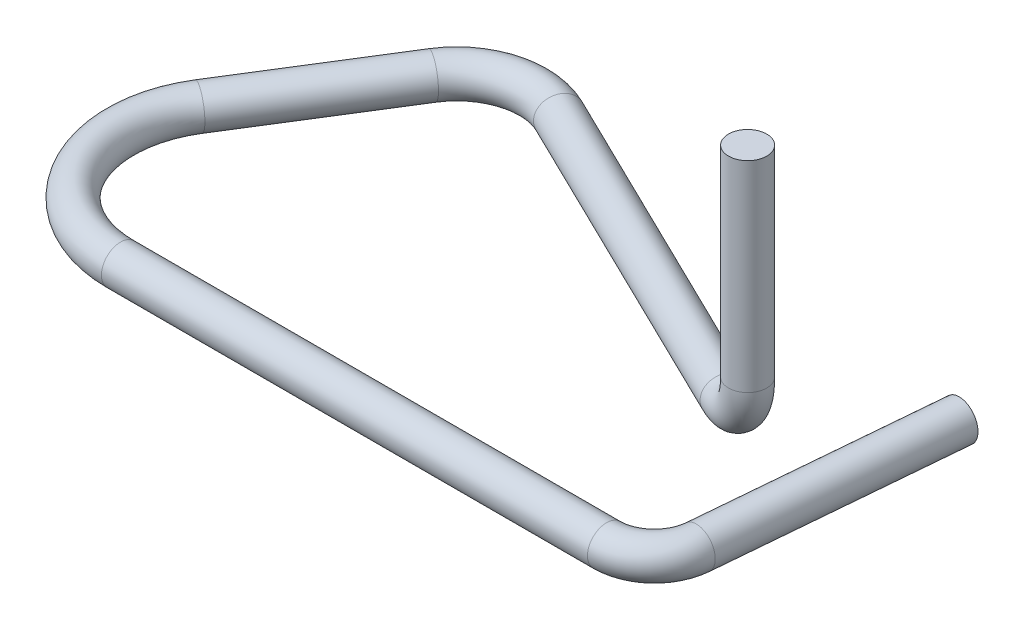
ISO-10303-21;
HEADER;
FILE_DESCRIPTION(('STEP AP214'),'2;1');
FILE_NAME('part.step','',(''),(''),'','','');
FILE_SCHEMA(('AUTOMOTIVE_DESIGN { 1 0 10303 214 1 1 1 1 }'));
ENDSEC;
DATA;
#1=APPLICATION_CONTEXT('core data for automotive mechanical design processes');
#2=APPLICATION_PROTOCOL_DEFINITION('international standard','automotive_design',2000,#1);
#3=PRODUCT_CONTEXT('',#1,'mechanical');
#4=PRODUCT('Part','Part','',(#3));
#5=PRODUCT_RELATED_PRODUCT_CATEGORY('part','',(#4));
#6=PRODUCT_DEFINITION_FORMATION('','',#4);
#7=PRODUCT_DEFINITION_CONTEXT('part definition',#1,'design');
#8=PRODUCT_DEFINITION('design','',#6,#7);
#9=PRODUCT_DEFINITION_SHAPE('','',#8);
#10=(LENGTH_UNIT() NAMED_UNIT(*) SI_UNIT(.MILLI.,.METRE.));
#11=(NAMED_UNIT(*) PLANE_ANGLE_UNIT() SI_UNIT($,.RADIAN.));
#12=(NAMED_UNIT(*) SI_UNIT($,.STERADIAN.) SOLID_ANGLE_UNIT());
#13=UNCERTAINTY_MEASURE_WITH_UNIT(LENGTH_MEASURE(1.E-05),#10,'distance_accuracy_value','');
#14=(GEOMETRIC_REPRESENTATION_CONTEXT(3) GLOBAL_UNCERTAINTY_ASSIGNED_CONTEXT((#13)) GLOBAL_UNIT_ASSIGNED_CONTEXT((#10,
#11,#12)) REPRESENTATION_CONTEXT('',''));
#15=CARTESIAN_POINT('',(0.,0.,0.));
#16=DIRECTION('',(0.,0.,1.));
#17=DIRECTION('',(1.,0.,0.));
#18=AXIS2_PLACEMENT_3D('',#15,#16,#17);
#19=CARTESIAN_POINT('',(17.7285697237176,0.,-1.66731220671047));
#20=DIRECTION('',(0.0871557427476609,0.,-0.996194698091745));
#21=DIRECTION('',(-0.996194698091745,0.,-0.0871557427476609));
#22=AXIS2_PLACEMENT_3D('',#19,#20,#21);
#23=CYLINDRICAL_SURFACE('',#22,0.508000000000002);
#24=CARTESIAN_POINT('',(17.7285697237176,0.,-1.66731220671047));
#25=DIRECTION('',(-0.0871557427476629,0.,0.996194698091745));
#26=DIRECTION('',(-0.895373863599654,-0.438371146789083,-0.078335062682381));
#27=AXIS2_PLACEMENT_3D('',#24,#25,#26);
#28=CIRCLE('',#27,0.508000000000002);
#29=CARTESIAN_POINT('',(18.2346366303482,0.,-1.62303708939466));
#30=VERTEX_POINT('',#29);
#31=EDGE_CURVE('E44',#30,#30,#28,.T.);
#32=ORIENTED_EDGE('',*,*,#31,.F.);
#33=EDGE_LOOP('',(#32));
#34=FACE_BOUND('',#33,.T.);
#35=CARTESIAN_POINT('',(18.2899330933694,0.,-8.08372488268419));
#36=DIRECTION('',(-0.0871557427476629,0.,0.996194698091745));
#37=DIRECTION('',(-0.895373863599654,-0.438371146789083,-0.078335062682381));
#38=AXIS2_PLACEMENT_3D('',#35,#36,#37);
#39=CIRCLE('',#38,0.508000000000002);
#40=CARTESIAN_POINT('',(17.8350831706608,-0.222692542568855,-8.12351909452684));
#41=VERTEX_POINT('',#40);
#42=EDGE_CURVE('E10',#41,#41,#39,.T.);
#43=ORIENTED_EDGE('',*,*,#42,.T.);
#44=EDGE_LOOP('',(#43));
#45=FACE_BOUND('',#44,.T.);
#46=ADVANCED_FACE('F37',(#34,#45),#23,.T.);
#47=CARTESIAN_POINT('',(16.4634024571411,0.,-1.778));
#48=DIRECTION('',(0.,1.,0.));
#49=DIRECTION('',(0.,0.,1.));
#50=AXIS2_PLACEMENT_3D('',#47,#48,#49);
#51=TOROIDAL_SURFACE('',#50,1.27,0.508000000000002);
#52=CARTESIAN_POINT('',(16.4634024571411,0.,-0.508000000000002));
#53=DIRECTION('',(-1.,0.,0.));
#54=DIRECTION('',(0.,-0.438371146789083,-0.898794046299165));
#55=AXIS2_PLACEMENT_3D('',#52,#53,#54);
#56=CIRCLE('',#55,0.508000000000002);
#57=CARTESIAN_POINT('',(16.4634024571411,0.,0.));
#58=VERTEX_POINT('',#57);
#59=EDGE_CURVE('E49',#58,#58,#56,.T.);
#60=CARTESIAN_POINT('',(16.4634024571411,0.,-1.778));
#61=DIRECTION('',(0.,1.,0.));
#62=DIRECTION('',(0.,0.,1.));
#63=AXIS2_PLACEMENT_3D('',#60,#61,#62);
#64=CIRCLE('',#63,1.778);
#65=EDGE_CURVE('',#58,#30,#64,.T.);
#66=ORIENTED_EDGE('',*,*,#59,.F.);
#67=ORIENTED_EDGE('',*,*,#31,.T.);
#68=ORIENTED_EDGE('',*,*,#65,.T.);
#69=ORIENTED_EDGE('',*,*,#65,.F.);
#70=EDGE_LOOP('',(#66,#68,#67,#69));
#71=FACE_BOUND('',#70,.T.);
#72=ADVANCED_FACE('F121',(#71),#51,.T.);
#73=CARTESIAN_POINT('',(3.556,0.,-0.508));
#74=DIRECTION('',(1.,0.,0.));
#75=DIRECTION('',(0.,0.,-1.));
#76=AXIS2_PLACEMENT_3D('',#73,#74,#75);
#77=CYLINDRICAL_SURFACE('',#76,0.508000000000002);
#78=CARTESIAN_POINT('',(3.556,0.,-0.508));
#79=DIRECTION('',(-1.,0.,0.));
#80=DIRECTION('',(0.,-0.438371146789083,-0.898794046299165));
#81=AXIS2_PLACEMENT_3D('',#78,#79,#80);
#82=CIRCLE('',#81,0.508000000000002);
#83=CARTESIAN_POINT('',(3.556,0.,0.));
#84=VERTEX_POINT('',#83);
#85=EDGE_CURVE('E54',#84,#84,#82,.T.);
#86=ORIENTED_EDGE('',*,*,#85,.F.);
#87=EDGE_LOOP('',(#86));
#88=FACE_BOUND('',#87,.T.);
#89=ORIENTED_EDGE('',*,*,#59,.T.);
#90=EDGE_LOOP('',(#89));
#91=FACE_BOUND('',#90,.T.);
#92=ADVANCED_FACE('F115',(#88,#91),#77,.T.);
#93=CARTESIAN_POINT('',(3.556,0.,-3.556));
#94=DIRECTION('',(0.,1.,0.));
#95=DIRECTION('',(0.,0.,1.));
#96=AXIS2_PLACEMENT_3D('',#93,#94,#95);
#97=TOROIDAL_SURFACE('',#96,3.048,0.508000000000002);
#98=CARTESIAN_POINT('',(0.971149402915214,0.,-5.17119391738281));
#99=DIRECTION('',(0.529919264233207,0.,-0.848048096156425));
#100=DIRECTION('',(0.762220579800736,-0.438371146789083,0.476288279712041));
#101=AXIS2_PLACEMENT_3D('',#98,#99,#100);
#102=CIRCLE('',#101,0.508000000000002);
#103=CARTESIAN_POINT('',(0.540340970067749,0.,-5.44039290361328));
#104=VERTEX_POINT('',#103);
#105=EDGE_CURVE('E60',#104,#104,#102,.T.);
#106=CARTESIAN_POINT('',(3.556,0.,-3.556));
#107=DIRECTION('',(0.,1.,0.));
#108=DIRECTION('',(0.,0.,1.));
#109=AXIS2_PLACEMENT_3D('',#106,#107,#108);
#110=CIRCLE('',#109,3.556);
#111=EDGE_CURVE('',#104,#84,#110,.T.);
#112=ORIENTED_EDGE('',*,*,#105,.F.);
#113=ORIENTED_EDGE('',*,*,#85,.T.);
#114=ORIENTED_EDGE('',*,*,#111,.T.);
#115=ORIENTED_EDGE('',*,*,#111,.F.);
#116=EDGE_LOOP('',(#112,#114,#113,#115));
#117=FACE_BOUND('',#116,.T.);
#118=ADVANCED_FACE('F109',(#117),#97,.T.);
#119=CARTESIAN_POINT('',(3.35676626861014,0.,-8.98897896061708));
#120=DIRECTION('',(-0.529919264233206,0.,0.848048096156425));
#121=DIRECTION('',(0.848048096156426,0.,0.529919264233206));
#122=AXIS2_PLACEMENT_3D('',#119,#120,#121);
#123=CYLINDRICAL_SURFACE('',#122,0.508000000000002);
#124=CARTESIAN_POINT('',(3.35676626861014,0.,-8.98897896061708));
#125=DIRECTION('',(0.529919264233207,0.,-0.848048096156425));
#126=DIRECTION('',(0.762220579800736,-0.438371146789083,0.476288279712041));
#127=AXIS2_PLACEMENT_3D('',#124,#125,#126);
#128=CIRCLE('',#127,0.508000000000002);
#129=CARTESIAN_POINT('',(2.92595783576267,0.,-9.25817794684755));
#130=VERTEX_POINT('',#129);
#131=EDGE_CURVE('E64',#130,#130,#128,.T.);
#132=ORIENTED_EDGE('',*,*,#131,.F.);
#133=EDGE_LOOP('',(#132));
#134=FACE_BOUND('',#133,.T.);
#135=ORIENTED_EDGE('',*,*,#105,.T.);
#136=EDGE_LOOP('',(#135));
#137=FACE_BOUND('',#136,.T.);
#138=ADVANCED_FACE('F103',(#134,#137),#123,.T.);
#139=CARTESIAN_POINT('',(5.08,0.,-7.91218301569521));
#140=DIRECTION('',(0.,1.,0.));
#141=DIRECTION('',(0.,0.,1.));
#142=AXIS2_PLACEMENT_3D('',#139,#140,#141);
#143=TOROIDAL_SURFACE('',#142,2.032,0.508000000000002);
#144=CARTESIAN_POINT('',(5.97077017027541,0.,-9.73853251777512));
#145=DIRECTION('',(0.898794046299165,0.,0.438371146789083));
#146=DIRECTION('',(-0.394005376803365,-0.438371146789083,0.807830737662825));
#147=AXIS2_PLACEMENT_3D('',#144,#145,#146);
#148=CIRCLE('',#147,0.508000000000002);
#149=CARTESIAN_POINT('',(6.19346271284427,0.,-10.1951198932951));
#150=VERTEX_POINT('',#149);
#151=EDGE_CURVE('E68',#150,#150,#148,.T.);
#152=CARTESIAN_POINT('',(5.08,0.,-7.91218301569521));
#153=DIRECTION('',(0.,1.,0.));
#154=DIRECTION('',(0.,0.,1.));
#155=AXIS2_PLACEMENT_3D('',#152,#153,#154);
#156=CIRCLE('',#155,2.54);
#157=EDGE_CURVE('',#150,#130,#156,.T.);
#158=ORIENTED_EDGE('',*,*,#151,.F.);
#159=ORIENTED_EDGE('',*,*,#131,.T.);
#160=ORIENTED_EDGE('',*,*,#157,.T.);
#161=ORIENTED_EDGE('',*,*,#157,.F.);
#162=EDGE_LOOP('',(#158,#160,#159,#161));
#163=FACE_BOUND('',#162,.T.);
#164=ADVANCED_FACE('F97',(#163),#143,.T.);
#165=CARTESIAN_POINT('',(14.6065315612001,0.,-5.52659026034225));
#166=DIRECTION('',(-0.898794046299164,0.,-0.438371146789083));
#167=DIRECTION('',(-0.438371146789083,0.,0.898794046299164));
#168=AXIS2_PLACEMENT_3D('',#165,#166,#167);
#169=CYLINDRICAL_SURFACE('',#168,0.508000000000002);
#170=CARTESIAN_POINT('',(14.6065315612001,0.,-5.52659026034225));
#171=DIRECTION('',(0.898794046299165,0.,0.438371146789083));
#172=DIRECTION('',(-0.394005376803365,-0.438371146789083,0.807830737662825));
#173=AXIS2_PLACEMENT_3D('',#170,#171,#172);
#174=CIRCLE('',#173,0.508000000000002);
#175=CARTESIAN_POINT('',(14.6065315612001,-0.508,-5.52659026034225));
#176=VERTEX_POINT('',#175);
#177=EDGE_CURVE('E72',#176,#176,#174,.T.);
#178=ORIENTED_EDGE('',*,*,#177,.F.);
#179=EDGE_LOOP('',(#178));
#180=FACE_BOUND('',#179,.T.);
#181=ORIENTED_EDGE('',*,*,#151,.T.);
#182=EDGE_LOOP('',(#181));
#183=FACE_BOUND('',#182,.T.);
#184=ADVANCED_FACE('F91',(#180,#183),#169,.T.);
#185=CARTESIAN_POINT('',(14.6065315612001,1.27,-5.52659026034225));
#186=DIRECTION('',(0.438371146789083,0.,-0.898794046299165));
#187=DIRECTION('',(-0.898794046299165,0.,-0.438371146789083));
#188=AXIS2_PLACEMENT_3D('',#185,#186,#187);
#189=TOROIDAL_SURFACE('',#188,1.27,0.508000000000002);
#190=CARTESIAN_POINT('',(15.748,1.27,-4.96985890392012));
#191=DIRECTION('',(0.,1.,0.));
#192=DIRECTION('',(0.,0.,1.));
#193=AXIS2_PLACEMENT_3D('',#190,#191,#192);
#194=CIRCLE('',#193,0.508000000000002);
#195=CARTESIAN_POINT('',(16.20458737552,1.27,-4.74716636135126));
#196=VERTEX_POINT('',#195);
#197=EDGE_CURVE('E76',#196,#196,#194,.T.);
#198=CARTESIAN_POINT('',(14.6065315612001,1.27,-5.52659026034225));
#199=DIRECTION('',(0.438371146789083,0.,-0.898794046299165));
#200=DIRECTION('',(-0.898794046299165,0.,-0.438371146789083));
#201=AXIS2_PLACEMENT_3D('',#198,#199,#200);
#202=CIRCLE('',#201,1.778);
#203=EDGE_CURVE('',#196,#176,#202,.T.);
#204=ORIENTED_EDGE('',*,*,#197,.F.);
#205=ORIENTED_EDGE('',*,*,#177,.T.);
#206=ORIENTED_EDGE('',*,*,#203,.T.);
#207=ORIENTED_EDGE('',*,*,#203,.F.);
#208=EDGE_LOOP('',(#204,#206,#205,#207));
#209=FACE_BOUND('',#208,.T.);
#210=ADVANCED_FACE('F88',(#209),#189,.T.);
#211=CARTESIAN_POINT('',(15.748,1.27,-4.96985890392012));
#212=DIRECTION('',(0.,1.,0.));
#213=DIRECTION('',(0.,0.,1.));
#214=AXIS2_PLACEMENT_3D('',#211,#212,#213);
#215=CYLINDRICAL_SURFACE('',#214,0.508000000000002);
#216=ORIENTED_EDGE('',*,*,#197,.T.);
#217=EDGE_LOOP('',(#216));
#218=FACE_BOUND('',#217,.T.);
#219=CARTESIAN_POINT('',(15.748,6.604,-4.96985890392012));
#220=DIRECTION('',(0.,1.,0.));
#221=DIRECTION('',(0.,0.,1.));
#222=AXIS2_PLACEMENT_3D('',#219,#220,#221);
#223=CIRCLE('',#222,0.508000000000002);
#224=CARTESIAN_POINT('',(15.748,6.604,-4.46185890392012));
#225=VERTEX_POINT('',#224);
#226=EDGE_CURVE('E77',#225,#225,#223,.T.);
#227=ORIENTED_EDGE('',*,*,#226,.F.);
#228=EDGE_LOOP('',(#227));
#229=FACE_BOUND('',#228,.T.);
#230=ADVANCED_FACE('F85',(#218,#229),#215,.T.);
#231=CARTESIAN_POINT('',(18.2899330933694,0.,-8.08372488268419));
#232=DIRECTION('',(-0.0871557427476629,0.,0.996194698091745));
#233=DIRECTION('',(-0.895373863599654,-0.438371146789083,-0.078335062682381));
#234=AXIS2_PLACEMENT_3D('',#231,#232,#233);
#235=PLANE('',#234);
#236=ORIENTED_EDGE('',*,*,#42,.F.);
#237=EDGE_LOOP('',(#236));
#238=FACE_BOUND('',#237,.T.);
#239=ADVANCED_FACE('F133',(#238),#235,.F.);
#240=CARTESIAN_POINT('',(15.748,6.604,-4.96985890392012));
#241=DIRECTION('',(0.,1.,0.));
#242=DIRECTION('',(0.,0.,1.));
#243=AXIS2_PLACEMENT_3D('',#240,#241,#242);
#244=PLANE('',#243);
#245=ORIENTED_EDGE('',*,*,#226,.T.);
#246=EDGE_LOOP('',(#245));
#247=FACE_BOUND('',#246,.T.);
#248=ADVANCED_FACE('F134',(#247),#244,.T.);
#249=CLOSED_SHELL('',(#46,#72,#92,#118,#138,#164,#184,#210,#230,#239,#248));
#250=MANIFOLD_SOLID_BREP('B2',#249);
#251=ADVANCED_BREP_SHAPE_REPRESENTATION('',(#18,#250),#14);
#252=SHAPE_DEFINITION_REPRESENTATION(#9,#251);
ENDSEC;
END-ISO-10303-21;
